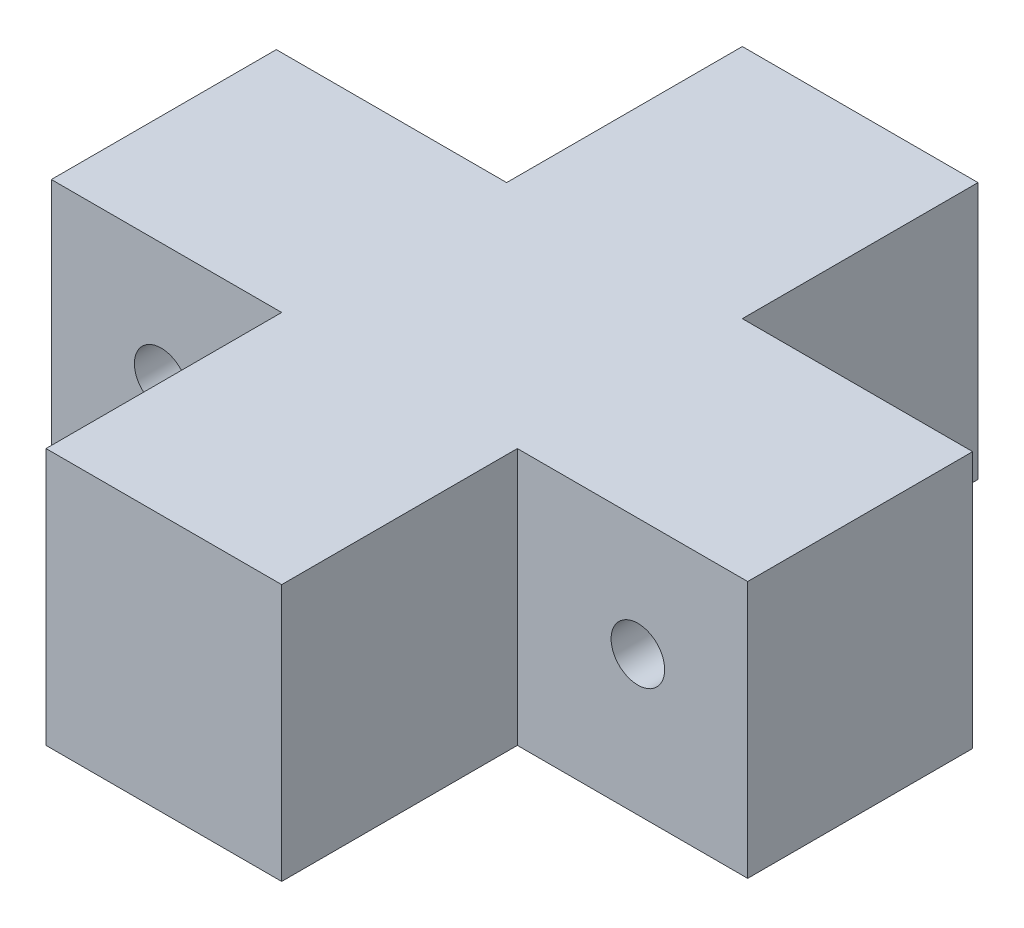
ISO-10303-21;
HEADER;
FILE_DESCRIPTION(('STEP AP214'),'2;1');
FILE_NAME('part.step','',(''),(''),'','','');
FILE_SCHEMA(('AUTOMOTIVE_DESIGN { 1 0 10303 214 1 1 1 1 }'));
ENDSEC;
DATA;
#1=APPLICATION_CONTEXT('core data for automotive mechanical design processes');
#2=APPLICATION_PROTOCOL_DEFINITION('international standard','automotive_design',2000,#1);
#3=PRODUCT_CONTEXT('',#1,'mechanical');
#4=PRODUCT('Part','Part','',(#3));
#5=PRODUCT_RELATED_PRODUCT_CATEGORY('part','',(#4));
#6=PRODUCT_DEFINITION_FORMATION('','',#4);
#7=PRODUCT_DEFINITION_CONTEXT('part definition',#1,'design');
#8=PRODUCT_DEFINITION('design','',#6,#7);
#9=PRODUCT_DEFINITION_SHAPE('','',#8);
#10=(LENGTH_UNIT() NAMED_UNIT(*) SI_UNIT(.MILLI.,.METRE.));
#11=(NAMED_UNIT(*) PLANE_ANGLE_UNIT() SI_UNIT($,.RADIAN.));
#12=(NAMED_UNIT(*) SI_UNIT($,.STERADIAN.) SOLID_ANGLE_UNIT());
#13=UNCERTAINTY_MEASURE_WITH_UNIT(LENGTH_MEASURE(1.E-05),#10,'distance_accuracy_value','');
#14=(GEOMETRIC_REPRESENTATION_CONTEXT(3) GLOBAL_UNCERTAINTY_ASSIGNED_CONTEXT((#13)) GLOBAL_UNIT_ASSIGNED_CONTEXT((#10,
#11,#12)) REPRESENTATION_CONTEXT('',''));
#15=CARTESIAN_POINT('',(0.,0.,0.));
#16=DIRECTION('',(0.,0.,1.));
#17=DIRECTION('',(1.,0.,0.));
#18=AXIS2_PLACEMENT_3D('',#15,#16,#17);
#19=CARTESIAN_POINT('',(32.5,24.,-32.5));
#20=DIRECTION('',(-1.,0.,0.));
#21=DIRECTION('',(0.,0.,1.));
#22=AXIS2_PLACEMENT_3D('',#19,#20,#21);
#23=PLANE('',#22);
#24=DIRECTION('',(0.,0.,-1.));
#25=VECTOR('',#24,1.);
#26=CARTESIAN_POINT('',(32.5,24.,-32.5));
#27=LINE('',#26,#25);
#28=CARTESIAN_POINT('',(32.5,24.,10.5));
#29=VERTEX_POINT('',#28);
#30=CARTESIAN_POINT('',(32.5,24.,-10.5));
#31=VERTEX_POINT('',#30);
#32=EDGE_CURVE('E165',#29,#31,#27,.T.);
#33=ORIENTED_EDGE('',*,*,#32,.F.);
#34=DIRECTION('',(0.,1.,0.));
#35=VECTOR('',#34,1.);
#36=CARTESIAN_POINT('',(32.5,0.,10.5));
#37=LINE('',#36,#35);
#38=CARTESIAN_POINT('',(32.5,0.,10.5));
#39=VERTEX_POINT('',#38);
#40=EDGE_CURVE('E196',#39,#29,#37,.T.);
#41=ORIENTED_EDGE('',*,*,#40,.F.);
#42=DIRECTION('',(0.,0.,-1.));
#43=VECTOR('',#42,1.);
#44=CARTESIAN_POINT('',(32.5,0.,-32.5));
#45=LINE('',#44,#43);
#46=CARTESIAN_POINT('',(32.5,0.,-10.5));
#47=VERTEX_POINT('',#46);
#48=EDGE_CURVE('E155',#39,#47,#45,.T.);
#49=ORIENTED_EDGE('',*,*,#48,.T.);
#50=DIRECTION('',(0.,1.,0.));
#51=VECTOR('',#50,1.);
#52=CARTESIAN_POINT('',(32.5,0.,-10.5));
#53=LINE('',#52,#51);
#54=EDGE_CURVE('E186',#47,#31,#53,.T.);
#55=ORIENTED_EDGE('',*,*,#54,.T.);
#56=EDGE_LOOP('',(#33,#41,#49,#55));
#57=FACE_BOUND('',#56,.T.);
#58=ADVANCED_FACE('F37',(#57),#23,.F.);
#59=CARTESIAN_POINT('',(-32.5,24.,-32.5));
#60=DIRECTION('',(0.,0.,1.));
#61=DIRECTION('',(1.,0.,0.));
#62=AXIS2_PLACEMENT_3D('',#59,#60,#61);
#63=PLANE('',#62);
#64=DIRECTION('',(-1.,0.,0.));
#65=VECTOR('',#64,1.);
#66=CARTESIAN_POINT('',(-32.5,24.,-32.5));
#67=LINE('',#66,#65);
#68=CARTESIAN_POINT('',(11.,24.,-32.5));
#69=VERTEX_POINT('',#68);
#70=CARTESIAN_POINT('',(-11.,24.,-32.5));
#71=VERTEX_POINT('',#70);
#72=EDGE_CURVE('E147',#69,#71,#67,.T.);
#73=ORIENTED_EDGE('',*,*,#72,.F.);
#74=DIRECTION('',(0.,1.,0.));
#75=VECTOR('',#74,1.);
#76=CARTESIAN_POINT('',(11.,0.,-32.5));
#77=LINE('',#76,#75);
#78=CARTESIAN_POINT('',(11.,0.,-32.5));
#79=VERTEX_POINT('',#78);
#80=EDGE_CURVE('E131',#79,#69,#77,.T.);
#81=ORIENTED_EDGE('',*,*,#80,.F.);
#82=DIRECTION('',(-1.,0.,0.));
#83=VECTOR('',#82,1.);
#84=CARTESIAN_POINT('',(-32.5,0.,-32.5));
#85=LINE('',#84,#83);
#86=CARTESIAN_POINT('',(-11.,0.,-32.5));
#87=VERTEX_POINT('',#86);
#88=EDGE_CURVE('E145',#79,#87,#85,.T.);
#89=ORIENTED_EDGE('',*,*,#88,.T.);
#90=DIRECTION('',(0.,1.,0.));
#91=VECTOR('',#90,1.);
#92=CARTESIAN_POINT('',(-11.,0.,-32.5));
#93=LINE('',#92,#91);
#94=EDGE_CURVE('E161',#87,#71,#93,.T.);
#95=ORIENTED_EDGE('',*,*,#94,.T.);
#96=EDGE_LOOP('',(#73,#81,#89,#95));
#97=FACE_BOUND('',#96,.T.);
#98=ADVANCED_FACE('F143',(#97),#63,.F.);
#99=CARTESIAN_POINT('',(-32.5,24.,-32.5));
#100=DIRECTION('',(1.,0.,0.));
#101=DIRECTION('',(0.,0.,-1.));
#102=AXIS2_PLACEMENT_3D('',#99,#100,#101);
#103=PLANE('',#102);
#104=DIRECTION('',(0.,0.,1.));
#105=VECTOR('',#104,1.);
#106=CARTESIAN_POINT('',(-32.5,0.,-32.5));
#107=LINE('',#106,#105);
#108=CARTESIAN_POINT('',(-32.5,0.,-10.5));
#109=VERTEX_POINT('',#108);
#110=CARTESIAN_POINT('',(-32.5,0.,10.5));
#111=VERTEX_POINT('',#110);
#112=EDGE_CURVE('E154',#109,#111,#107,.T.);
#113=ORIENTED_EDGE('',*,*,#112,.T.);
#114=DIRECTION('',(0.,1.,0.));
#115=VECTOR('',#114,1.);
#116=CARTESIAN_POINT('',(-32.5,0.,10.5));
#117=LINE('',#116,#115);
#118=CARTESIAN_POINT('',(-32.5,24.,10.5));
#119=VERTEX_POINT('',#118);
#120=EDGE_CURVE('E200',#111,#119,#117,.T.);
#121=ORIENTED_EDGE('',*,*,#120,.T.);
#122=DIRECTION('',(0.,0.,1.));
#123=VECTOR('',#122,1.);
#124=CARTESIAN_POINT('',(-32.5,24.,-32.5));
#125=LINE('',#124,#123);
#126=CARTESIAN_POINT('',(-32.5,24.,-10.5));
#127=VERTEX_POINT('',#126);
#128=EDGE_CURVE('E45',#127,#119,#125,.T.);
#129=ORIENTED_EDGE('',*,*,#128,.F.);
#130=DIRECTION('',(0.,1.,0.));
#131=VECTOR('',#130,1.);
#132=CARTESIAN_POINT('',(-32.5,0.,-10.5));
#133=LINE('',#132,#131);
#134=EDGE_CURVE('E224',#109,#127,#133,.T.);
#135=ORIENTED_EDGE('',*,*,#134,.F.);
#136=EDGE_LOOP('',(#113,#121,#129,#135));
#137=FACE_BOUND('',#136,.T.);
#138=ADVANCED_FACE('F245',(#137),#103,.F.);
#139=CARTESIAN_POINT('',(-32.5,24.,32.5));
#140=DIRECTION('',(0.,0.,-1.));
#141=DIRECTION('',(-1.,0.,0.));
#142=AXIS2_PLACEMENT_3D('',#139,#140,#141);
#143=PLANE('',#142);
#144=DIRECTION('',(1.,0.,0.));
#145=VECTOR('',#144,1.);
#146=CARTESIAN_POINT('',(-32.5,24.,32.5));
#147=LINE('',#146,#145);
#148=CARTESIAN_POINT('',(-11.,24.,32.5));
#149=VERTEX_POINT('',#148);
#150=CARTESIAN_POINT('',(11.,24.,32.5));
#151=VERTEX_POINT('',#150);
#152=EDGE_CURVE('E11',#149,#151,#147,.T.);
#153=ORIENTED_EDGE('',*,*,#152,.F.);
#154=DIRECTION('',(0.,1.,0.));
#155=VECTOR('',#154,1.);
#156=CARTESIAN_POINT('',(-11.,0.,32.5));
#157=LINE('',#156,#155);
#158=CARTESIAN_POINT('',(-11.,0.,32.5));
#159=VERTEX_POINT('',#158);
#160=EDGE_CURVE('E211',#159,#149,#157,.T.);
#161=ORIENTED_EDGE('',*,*,#160,.F.);
#162=DIRECTION('',(1.,0.,0.));
#163=VECTOR('',#162,1.);
#164=CARTESIAN_POINT('',(-32.5,0.,32.5));
#165=LINE('',#164,#163);
#166=CARTESIAN_POINT('',(11.,0.,32.5));
#167=VERTEX_POINT('',#166);
#168=EDGE_CURVE('E158',#159,#167,#165,.T.);
#169=ORIENTED_EDGE('',*,*,#168,.T.);
#170=DIRECTION('',(0.,1.,0.));
#171=VECTOR('',#170,1.);
#172=CARTESIAN_POINT('',(11.,0.,32.5));
#173=LINE('',#172,#171);
#174=EDGE_CURVE('E184',#167,#151,#173,.T.);
#175=ORIENTED_EDGE('',*,*,#174,.T.);
#176=EDGE_LOOP('',(#153,#161,#169,#175));
#177=FACE_BOUND('',#176,.T.);
#178=ADVANCED_FACE('F254',(#177),#143,.F.);
#179=CARTESIAN_POINT('',(0.,24.,0.));
#180=DIRECTION('',(0.,1.,0.));
#181=DIRECTION('',(0.,0.,1.));
#182=AXIS2_PLACEMENT_3D('',#179,#180,#181);
#183=PLANE('',#182);
#184=DIRECTION('',(-1.,0.,0.));
#185=VECTOR('',#184,1.);
#186=CARTESIAN_POINT('',(-32.5,24.,10.5));
#187=LINE('',#186,#185);
#188=CARTESIAN_POINT('',(-11.,24.,10.5));
#189=VERTEX_POINT('',#188);
#190=EDGE_CURVE('E209',#189,#119,#187,.T.);
#191=ORIENTED_EDGE('',*,*,#190,.F.);
#192=DIRECTION('',(0.,0.,-1.));
#193=VECTOR('',#192,1.);
#194=CARTESIAN_POINT('',(-11.,24.,10.5));
#195=LINE('',#194,#193);
#196=EDGE_CURVE('E179',#149,#189,#195,.T.);
#197=ORIENTED_EDGE('',*,*,#196,.F.);
#198=ORIENTED_EDGE('',*,*,#152,.T.);
#199=DIRECTION('',(0.,0.,1.));
#200=VECTOR('',#199,1.);
#201=CARTESIAN_POINT('',(11.,24.,10.5));
#202=LINE('',#201,#200);
#203=CARTESIAN_POINT('',(11.,24.,10.5));
#204=VERTEX_POINT('',#203);
#205=EDGE_CURVE('E194',#204,#151,#202,.T.);
#206=ORIENTED_EDGE('',*,*,#205,.F.);
#207=DIRECTION('',(-1.,0.,0.));
#208=VECTOR('',#207,1.);
#209=CARTESIAN_POINT('',(32.5,24.,10.5));
#210=LINE('',#209,#208);
#211=EDGE_CURVE('E197',#29,#204,#210,.T.);
#212=ORIENTED_EDGE('',*,*,#211,.F.);
#213=ORIENTED_EDGE('',*,*,#32,.T.);
#214=DIRECTION('',(1.,0.,0.));
#215=VECTOR('',#214,1.);
#216=CARTESIAN_POINT('',(32.5,24.,-10.5));
#217=LINE('',#216,#215);
#218=CARTESIAN_POINT('',(11.,24.,-10.5));
#219=VERTEX_POINT('',#218);
#220=EDGE_CURVE('E138',#219,#31,#217,.T.);
#221=ORIENTED_EDGE('',*,*,#220,.F.);
#222=DIRECTION('',(0.,0.,1.));
#223=VECTOR('',#222,1.);
#224=CARTESIAN_POINT('',(11.,24.,-10.5));
#225=LINE('',#224,#223);
#226=EDGE_CURVE('E182',#69,#219,#225,.T.);
#227=ORIENTED_EDGE('',*,*,#226,.F.);
#228=ORIENTED_EDGE('',*,*,#72,.T.);
#229=DIRECTION('',(0.,0.,-1.));
#230=VECTOR('',#229,1.);
#231=CARTESIAN_POINT('',(-11.,24.,-10.5));
#232=LINE('',#231,#230);
#233=CARTESIAN_POINT('',(-11.,24.,-10.5));
#234=VERTEX_POINT('',#233);
#235=EDGE_CURVE('E222',#234,#71,#232,.T.);
#236=ORIENTED_EDGE('',*,*,#235,.F.);
#237=DIRECTION('',(1.,0.,0.));
#238=VECTOR('',#237,1.);
#239=CARTESIAN_POINT('',(-32.5,24.,-10.5));
#240=LINE('',#239,#238);
#241=EDGE_CURVE('E189',#127,#234,#240,.T.);
#242=ORIENTED_EDGE('',*,*,#241,.F.);
#243=ORIENTED_EDGE('',*,*,#128,.T.);
#244=EDGE_LOOP('',(#191,#197,#198,#206,#212,#213,#221,#227,#228,#236,#242,#243));
#245=FACE_BOUND('',#244,.T.);
#246=ADVANCED_FACE('F240',(#245),#183,.T.);
#247=CARTESIAN_POINT('',(0.,0.,0.));
#248=DIRECTION('',(0.,1.,0.));
#249=DIRECTION('',(0.,0.,1.));
#250=AXIS2_PLACEMENT_3D('',#247,#248,#249);
#251=PLANE('',#250);
#252=DIRECTION('',(0.,0.,-1.));
#253=VECTOR('',#252,1.);
#254=CARTESIAN_POINT('',(-11.,0.,10.5));
#255=LINE('',#254,#253);
#256=CARTESIAN_POINT('',(-11.,0.,10.5));
#257=VERTEX_POINT('',#256);
#258=EDGE_CURVE('E207',#159,#257,#255,.T.);
#259=ORIENTED_EDGE('',*,*,#258,.T.);
#260=DIRECTION('',(-1.,0.,0.));
#261=VECTOR('',#260,1.);
#262=CARTESIAN_POINT('',(-32.5,0.,10.5));
#263=LINE('',#262,#261);
#264=EDGE_CURVE('E53',#257,#111,#263,.T.);
#265=ORIENTED_EDGE('',*,*,#264,.T.);
#266=ORIENTED_EDGE('',*,*,#112,.F.);
#267=DIRECTION('',(1.,0.,0.));
#268=VECTOR('',#267,1.);
#269=CARTESIAN_POINT('',(-32.5,0.,-10.5));
#270=LINE('',#269,#268);
#271=CARTESIAN_POINT('',(-11.,0.,-10.5));
#272=VERTEX_POINT('',#271);
#273=EDGE_CURVE('E220',#109,#272,#270,.T.);
#274=ORIENTED_EDGE('',*,*,#273,.T.);
#275=DIRECTION('',(0.,0.,-1.));
#276=VECTOR('',#275,1.);
#277=CARTESIAN_POINT('',(-11.,0.,-10.5));
#278=LINE('',#277,#276);
#279=EDGE_CURVE('E153',#272,#87,#278,.T.);
#280=ORIENTED_EDGE('',*,*,#279,.T.);
#281=ORIENTED_EDGE('',*,*,#88,.F.);
#282=DIRECTION('',(0.,0.,1.));
#283=VECTOR('',#282,1.);
#284=CARTESIAN_POINT('',(11.,0.,-10.5));
#285=LINE('',#284,#283);
#286=CARTESIAN_POINT('',(11.,0.,-10.5));
#287=VERTEX_POINT('',#286);
#288=EDGE_CURVE('E127',#79,#287,#285,.T.);
#289=ORIENTED_EDGE('',*,*,#288,.T.);
#290=DIRECTION('',(1.,0.,0.));
#291=VECTOR('',#290,1.);
#292=CARTESIAN_POINT('',(32.5,0.,-10.5));
#293=LINE('',#292,#291);
#294=EDGE_CURVE('E137',#287,#47,#293,.T.);
#295=ORIENTED_EDGE('',*,*,#294,.T.);
#296=ORIENTED_EDGE('',*,*,#48,.F.);
#297=DIRECTION('',(-1.,0.,0.));
#298=VECTOR('',#297,1.);
#299=CARTESIAN_POINT('',(32.5,0.,10.5));
#300=LINE('',#299,#298);
#301=CARTESIAN_POINT('',(11.,0.,10.5));
#302=VERTEX_POINT('',#301);
#303=EDGE_CURVE('E191',#39,#302,#300,.T.);
#304=ORIENTED_EDGE('',*,*,#303,.T.);
#305=DIRECTION('',(0.,0.,1.));
#306=VECTOR('',#305,1.);
#307=CARTESIAN_POINT('',(11.,0.,10.5));
#308=LINE('',#307,#306);
#309=EDGE_CURVE('E61',#302,#167,#308,.T.);
#310=ORIENTED_EDGE('',*,*,#309,.T.);
#311=ORIENTED_EDGE('',*,*,#168,.F.);
#312=EDGE_LOOP('',(#259,#265,#266,#274,#280,#281,#289,#295,#296,#304,#310,#311));
#313=FACE_BOUND('',#312,.T.);
#314=ADVANCED_FACE('F151',(#313),#251,.F.);
#315=CARTESIAN_POINT('',(-11.,0.,-10.5));
#316=DIRECTION('',(1.,0.,0.));
#317=DIRECTION('',(0.,0.,-1.));
#318=AXIS2_PLACEMENT_3D('',#315,#316,#317);
#319=PLANE('',#318);
#320=ORIENTED_EDGE('',*,*,#235,.T.);
#321=ORIENTED_EDGE('',*,*,#94,.F.);
#322=ORIENTED_EDGE('',*,*,#279,.F.);
#323=DIRECTION('',(0.,1.,0.));
#324=VECTOR('',#323,1.);
#325=CARTESIAN_POINT('',(-11.,0.,-10.5));
#326=LINE('',#325,#324);
#327=EDGE_CURVE('E229',#272,#234,#326,.T.);
#328=ORIENTED_EDGE('',*,*,#327,.T.);
#329=EDGE_LOOP('',(#320,#321,#322,#328));
#330=FACE_BOUND('',#329,.T.);
#331=ADVANCED_FACE('F268',(#330),#319,.F.);
#332=CARTESIAN_POINT('',(-32.5,0.,-10.5));
#333=DIRECTION('',(0.,0.,1.));
#334=DIRECTION('',(1.,0.,0.));
#335=AXIS2_PLACEMENT_3D('',#332,#333,#334);
#336=PLANE('',#335);
#337=CARTESIAN_POINT('',(-22.25,13.,-10.5));
#338=DIRECTION('',(0.,0.,1.));
#339=DIRECTION('',(1.,0.,0.));
#340=AXIS2_PLACEMENT_3D('',#337,#338,#339);
#341=CIRCLE('',#340,2.5);
#342=CARTESIAN_POINT('',(-19.75,13.,-10.5));
#343=VERTEX_POINT('',#342);
#344=EDGE_CURVE('E168',#343,#343,#341,.T.);
#345=ORIENTED_EDGE('',*,*,#344,.T.);
#346=EDGE_LOOP('',(#345));
#347=FACE_BOUND('',#346,.T.);
#348=ORIENTED_EDGE('',*,*,#241,.T.);
#349=ORIENTED_EDGE('',*,*,#327,.F.);
#350=ORIENTED_EDGE('',*,*,#273,.F.);
#351=ORIENTED_EDGE('',*,*,#134,.T.);
#352=EDGE_LOOP('',(#348,#349,#350,#351));
#353=FACE_BOUND('',#352,.T.);
#354=ADVANCED_FACE('F271',(#347,#353),#336,.F.);
#355=CARTESIAN_POINT('',(32.5,0.,-10.5));
#356=DIRECTION('',(0.,0.,1.));
#357=DIRECTION('',(1.,0.,0.));
#358=AXIS2_PLACEMENT_3D('',#355,#356,#357);
#359=PLANE('',#358);
#360=CARTESIAN_POINT('',(22.25,13.,-10.5));
#361=DIRECTION('',(0.,0.,1.));
#362=DIRECTION('',(1.,0.,0.));
#363=AXIS2_PLACEMENT_3D('',#360,#361,#362);
#364=CIRCLE('',#363,2.5);
#365=CARTESIAN_POINT('',(24.75,13.,-10.5));
#366=VERTEX_POINT('',#365);
#367=EDGE_CURVE('E176',#366,#366,#364,.T.);
#368=ORIENTED_EDGE('',*,*,#367,.T.);
#369=EDGE_LOOP('',(#368));
#370=FACE_BOUND('',#369,.T.);
#371=ORIENTED_EDGE('',*,*,#220,.T.);
#372=ORIENTED_EDGE('',*,*,#54,.F.);
#373=ORIENTED_EDGE('',*,*,#294,.F.);
#374=DIRECTION('',(0.,1.,0.));
#375=VECTOR('',#374,1.);
#376=CARTESIAN_POINT('',(11.,0.,-10.5));
#377=LINE('',#376,#375);
#378=EDGE_CURVE('E133',#287,#219,#377,.T.);
#379=ORIENTED_EDGE('',*,*,#378,.T.);
#380=EDGE_LOOP('',(#371,#372,#373,#379));
#381=FACE_BOUND('',#380,.T.);
#382=ADVANCED_FACE('F265',(#370,#381),#359,.F.);
#383=CARTESIAN_POINT('',(11.,0.,-10.5));
#384=DIRECTION('',(-1.,0.,0.));
#385=DIRECTION('',(0.,0.,1.));
#386=AXIS2_PLACEMENT_3D('',#383,#384,#385);
#387=PLANE('',#386);
#388=ORIENTED_EDGE('',*,*,#226,.T.);
#389=ORIENTED_EDGE('',*,*,#378,.F.);
#390=ORIENTED_EDGE('',*,*,#288,.F.);
#391=ORIENTED_EDGE('',*,*,#80,.T.);
#392=EDGE_LOOP('',(#388,#389,#390,#391));
#393=FACE_BOUND('',#392,.T.);
#394=ADVANCED_FACE('F130',(#393),#387,.F.);
#395=CARTESIAN_POINT('',(11.,0.,10.5));
#396=DIRECTION('',(-1.,0.,0.));
#397=DIRECTION('',(0.,0.,1.));
#398=AXIS2_PLACEMENT_3D('',#395,#396,#397);
#399=PLANE('',#398);
#400=ORIENTED_EDGE('',*,*,#205,.T.);
#401=ORIENTED_EDGE('',*,*,#174,.F.);
#402=ORIENTED_EDGE('',*,*,#309,.F.);
#403=DIRECTION('',(0.,1.,0.));
#404=VECTOR('',#403,1.);
#405=CARTESIAN_POINT('',(11.,0.,10.5));
#406=LINE('',#405,#404);
#407=EDGE_CURVE('E204',#302,#204,#406,.T.);
#408=ORIENTED_EDGE('',*,*,#407,.T.);
#409=EDGE_LOOP('',(#400,#401,#402,#408));
#410=FACE_BOUND('',#409,.T.);
#411=ADVANCED_FACE('F258',(#410),#399,.F.);
#412=CARTESIAN_POINT('',(32.5,0.,10.5));
#413=DIRECTION('',(0.,0.,-1.));
#414=DIRECTION('',(-1.,0.,0.));
#415=AXIS2_PLACEMENT_3D('',#412,#413,#414);
#416=PLANE('',#415);
#417=CARTESIAN_POINT('',(22.25,13.,10.5));
#418=DIRECTION('',(0.,0.,-1.));
#419=DIRECTION('',(-1.,0.,0.));
#420=AXIS2_PLACEMENT_3D('',#417,#418,#419);
#421=CIRCLE('',#420,2.5);
#422=CARTESIAN_POINT('',(19.75,13.,10.5));
#423=VERTEX_POINT('',#422);
#424=EDGE_CURVE('E40',#423,#423,#421,.T.);
#425=ORIENTED_EDGE('',*,*,#424,.T.);
#426=EDGE_LOOP('',(#425));
#427=FACE_BOUND('',#426,.T.);
#428=ORIENTED_EDGE('',*,*,#211,.T.);
#429=ORIENTED_EDGE('',*,*,#407,.F.);
#430=ORIENTED_EDGE('',*,*,#303,.F.);
#431=ORIENTED_EDGE('',*,*,#40,.T.);
#432=EDGE_LOOP('',(#428,#429,#430,#431));
#433=FACE_BOUND('',#432,.T.);
#434=ADVANCED_FACE('F260',(#427,#433),#416,.F.);
#435=CARTESIAN_POINT('',(-32.5,0.,10.5));
#436=DIRECTION('',(0.,0.,-1.));
#437=DIRECTION('',(-1.,0.,0.));
#438=AXIS2_PLACEMENT_3D('',#435,#436,#437);
#439=PLANE('',#438);
#440=CARTESIAN_POINT('',(-22.25,13.,10.5));
#441=DIRECTION('',(0.,0.,-1.));
#442=DIRECTION('',(-1.,0.,0.));
#443=AXIS2_PLACEMENT_3D('',#440,#441,#442);
#444=CIRCLE('',#443,2.5);
#445=CARTESIAN_POINT('',(-24.75,13.,10.5));
#446=VERTEX_POINT('',#445);
#447=EDGE_CURVE('E166',#446,#446,#444,.T.);
#448=ORIENTED_EDGE('',*,*,#447,.T.);
#449=EDGE_LOOP('',(#448));
#450=FACE_BOUND('',#449,.T.);
#451=ORIENTED_EDGE('',*,*,#190,.T.);
#452=ORIENTED_EDGE('',*,*,#120,.F.);
#453=ORIENTED_EDGE('',*,*,#264,.F.);
#454=DIRECTION('',(0.,1.,0.));
#455=VECTOR('',#454,1.);
#456=CARTESIAN_POINT('',(-11.,0.,10.5));
#457=LINE('',#456,#455);
#458=EDGE_CURVE('E217',#257,#189,#457,.T.);
#459=ORIENTED_EDGE('',*,*,#458,.T.);
#460=EDGE_LOOP('',(#451,#452,#453,#459));
#461=FACE_BOUND('',#460,.T.);
#462=ADVANCED_FACE('F247',(#450,#461),#439,.F.);
#463=CARTESIAN_POINT('',(-11.,0.,10.5));
#464=DIRECTION('',(1.,0.,0.));
#465=DIRECTION('',(0.,0.,-1.));
#466=AXIS2_PLACEMENT_3D('',#463,#464,#465);
#467=PLANE('',#466);
#468=ORIENTED_EDGE('',*,*,#196,.T.);
#469=ORIENTED_EDGE('',*,*,#458,.F.);
#470=ORIENTED_EDGE('',*,*,#258,.F.);
#471=ORIENTED_EDGE('',*,*,#160,.T.);
#472=EDGE_LOOP('',(#468,#469,#470,#471));
#473=FACE_BOUND('',#472,.T.);
#474=ADVANCED_FACE('F251',(#473),#467,.F.);
#475=CARTESIAN_POINT('',(-22.25,13.,-32.5));
#476=DIRECTION('',(0.,0.,1.));
#477=DIRECTION('',(1.,0.,0.));
#478=AXIS2_PLACEMENT_3D('',#475,#476,#477);
#479=CYLINDRICAL_SURFACE('',#478,2.5);
#480=ORIENTED_EDGE('',*,*,#447,.F.);
#481=EDGE_LOOP('',(#480));
#482=FACE_BOUND('',#481,.T.);
#483=ORIENTED_EDGE('',*,*,#344,.F.);
#484=EDGE_LOOP('',(#483));
#485=FACE_BOUND('',#484,.T.);
#486=ADVANCED_FACE('F335',(#482,#485),#479,.F.);
#487=CARTESIAN_POINT('',(22.25,13.,-32.5));
#488=DIRECTION('',(0.,0.,1.));
#489=DIRECTION('',(1.,0.,0.));
#490=AXIS2_PLACEMENT_3D('',#487,#488,#489);
#491=CYLINDRICAL_SURFACE('',#490,2.5);
#492=ORIENTED_EDGE('',*,*,#424,.F.);
#493=EDGE_LOOP('',(#492));
#494=FACE_BOUND('',#493,.T.);
#495=ORIENTED_EDGE('',*,*,#367,.F.);
#496=EDGE_LOOP('',(#495));
#497=FACE_BOUND('',#496,.T.);
#498=ADVANCED_FACE('F368',(#494,#497),#491,.F.);
#499=CLOSED_SHELL('',(#58,#98,#138,#178,#246,#314,#331,#354,#382,#394,#411,#434,#462,#474,#486,#498));
#500=MANIFOLD_SOLID_BREP('B2',#499);
#501=ADVANCED_BREP_SHAPE_REPRESENTATION('',(#18,#500),#14);
#502=SHAPE_DEFINITION_REPRESENTATION(#9,#501);
ENDSEC;
END-ISO-10303-21;
